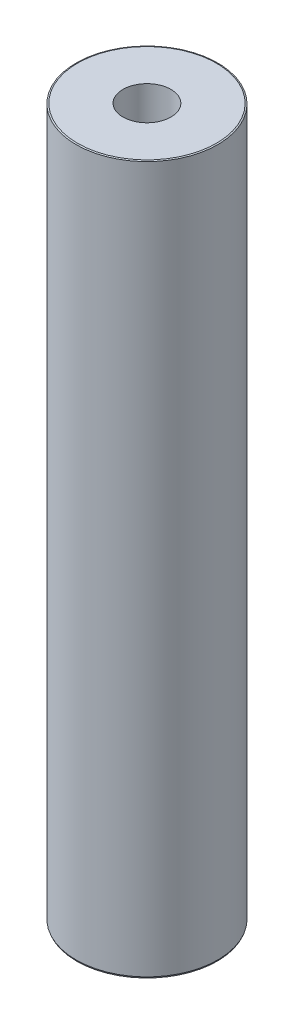
ISO-10303-21;
HEADER;
FILE_DESCRIPTION(('STEP AP214'),'2;1');
FILE_NAME('part.step','',(''),(''),'','','');
FILE_SCHEMA(('AUTOMOTIVE_DESIGN { 1 0 10303 214 1 1 1 1 }'));
ENDSEC;
DATA;
#1=APPLICATION_CONTEXT('core data for automotive mechanical design processes');
#2=APPLICATION_PROTOCOL_DEFINITION('international standard','automotive_design',2000,#1);
#3=PRODUCT_CONTEXT('',#1,'mechanical');
#4=PRODUCT('Part','Part','',(#3));
#5=PRODUCT_RELATED_PRODUCT_CATEGORY('part','',(#4));
#6=PRODUCT_DEFINITION_FORMATION('','',#4);
#7=PRODUCT_DEFINITION_CONTEXT('part definition',#1,'design');
#8=PRODUCT_DEFINITION('design','',#6,#7);
#9=PRODUCT_DEFINITION_SHAPE('','',#8);
#10=(LENGTH_UNIT() NAMED_UNIT(*) SI_UNIT(.MILLI.,.METRE.));
#11=(NAMED_UNIT(*) PLANE_ANGLE_UNIT() SI_UNIT($,.RADIAN.));
#12=(NAMED_UNIT(*) SI_UNIT($,.STERADIAN.) SOLID_ANGLE_UNIT());
#13=UNCERTAINTY_MEASURE_WITH_UNIT(LENGTH_MEASURE(1.E-05),#10,'distance_accuracy_value','');
#14=(GEOMETRIC_REPRESENTATION_CONTEXT(3) GLOBAL_UNCERTAINTY_ASSIGNED_CONTEXT((#13)) GLOBAL_UNIT_ASSIGNED_CONTEXT((#10,
#11,#12)) REPRESENTATION_CONTEXT('',''));
#15=CARTESIAN_POINT('',(0.,0.,0.));
#16=DIRECTION('',(0.,0.,1.));
#17=DIRECTION('',(1.,0.,0.));
#18=AXIS2_PLACEMENT_3D('',#15,#16,#17);
#19=CARTESIAN_POINT('',(0.,600.,0.));
#20=DIRECTION('',(0.,-1.,0.));
#21=DIRECTION('',(0.,0.,-1.));
#22=AXIS2_PLACEMENT_3D('',#19,#20,#21);
#23=CYLINDRICAL_SURFACE('',#22,60.);
#24=CARTESIAN_POINT('',(0.,599.572975668036,0.));
#25=DIRECTION('',(0.,1.,0.));
#26=DIRECTION('',(0.,0.,1.));
#27=AXIS2_PLACEMENT_3D('',#24,#25,#26);
#28=CIRCLE('',#27,60.);
#29=CARTESIAN_POINT('',(0.,599.572975668036,60.));
#30=VERTEX_POINT('',#29);
#31=EDGE_CURVE('E50',#30,#30,#28,.F.);
#32=ORIENTED_EDGE('',*,*,#31,.T.);
#33=EDGE_LOOP('',(#32));
#34=FACE_BOUND('',#33,.T.);
#35=CARTESIAN_POINT('',(0.,1.14513133027427,0.));
#36=DIRECTION('',(0.,1.,0.));
#37=DIRECTION('',(0.,0.,1.));
#38=AXIS2_PLACEMENT_3D('',#35,#36,#37);
#39=CIRCLE('',#38,60.);
#40=CARTESIAN_POINT('',(0.,1.14513133027427,60.));
#41=VERTEX_POINT('',#40);
#42=EDGE_CURVE('E51',#41,#41,#39,.T.);
#43=ORIENTED_EDGE('',*,*,#42,.T.);
#44=EDGE_LOOP('',(#43));
#45=FACE_BOUND('',#44,.T.);
#46=ADVANCED_FACE('F39',(#34,#45),#23,.T.);
#47=CARTESIAN_POINT('',(0.,600.,0.));
#48=DIRECTION('',(0.,1.,0.));
#49=DIRECTION('',(0.,0.,1.));
#50=AXIS2_PLACEMENT_3D('',#47,#48,#49);
#51=PLANE('',#50);
#52=CARTESIAN_POINT('',(0.,600.,0.));
#53=DIRECTION('',(0.,1.,0.));
#54=DIRECTION('',(0.,0.,1.));
#55=AXIS2_PLACEMENT_3D('',#52,#53,#54);
#56=CIRCLE('',#55,58.8548686697261);
#57=CARTESIAN_POINT('',(0.,600.,58.8548686697261));
#58=VERTEX_POINT('',#57);
#59=EDGE_CURVE('E54',#58,#58,#56,.T.);
#60=ORIENTED_EDGE('',*,*,#59,.T.);
#61=EDGE_LOOP('',(#60));
#62=FACE_BOUND('',#61,.T.);
#63=CARTESIAN_POINT('',(0.,600.,0.));
#64=DIRECTION('',(0.,1.,0.));
#65=DIRECTION('',(0.,0.,1.));
#66=AXIS2_PLACEMENT_3D('',#63,#64,#65);
#67=CIRCLE('',#66,20.3346537944548);
#68=CARTESIAN_POINT('',(0.,600.,20.3346537944548));
#69=VERTEX_POINT('',#68);
#70=EDGE_CURVE('E58',#69,#69,#67,.T.);
#71=ORIENTED_EDGE('',*,*,#70,.F.);
#72=EDGE_LOOP('',(#71));
#73=FACE_BOUND('',#72,.T.);
#74=ADVANCED_FACE('F69',(#62,#73),#51,.T.);
#75=CARTESIAN_POINT('',(0.,0.,0.));
#76=DIRECTION('',(0.,1.,0.));
#77=DIRECTION('',(0.,0.,1.));
#78=AXIS2_PLACEMENT_3D('',#75,#76,#77);
#79=PLANE('',#78);
#80=CARTESIAN_POINT('',(0.,0.,0.));
#81=DIRECTION('',(0.,1.,0.));
#82=DIRECTION('',(0.,0.,1.));
#83=AXIS2_PLACEMENT_3D('',#80,#81,#82);
#84=CIRCLE('',#83,59.5729756680359);
#85=CARTESIAN_POINT('',(0.,0.,59.5729756680359));
#86=VERTEX_POINT('',#85);
#87=EDGE_CURVE('E10',#86,#86,#84,.F.);
#88=ORIENTED_EDGE('',*,*,#87,.T.);
#89=EDGE_LOOP('',(#88));
#90=FACE_BOUND('',#89,.T.);
#91=CARTESIAN_POINT('',(0.,0.,0.));
#92=DIRECTION('',(0.,1.,0.));
#93=DIRECTION('',(0.,0.,1.));
#94=AXIS2_PLACEMENT_3D('',#91,#92,#93);
#95=CIRCLE('',#94,20.3346537944548);
#96=CARTESIAN_POINT('',(0.,0.,20.3346537944548));
#97=VERTEX_POINT('',#96);
#98=EDGE_CURVE('E63',#97,#97,#95,.T.);
#99=ORIENTED_EDGE('',*,*,#98,.T.);
#100=EDGE_LOOP('',(#99));
#101=FACE_BOUND('',#100,.T.);
#102=ADVANCED_FACE('F75',(#90,#101),#79,.F.);
#103=CARTESIAN_POINT('',(0.,600.,0.));
#104=DIRECTION('',(0.,-1.,0.));
#105=DIRECTION('',(0.,0.,-1.));
#106=AXIS2_PLACEMENT_3D('',#103,#104,#105);
#107=CYLINDRICAL_SURFACE('',#106,20.3346537944548);
#108=ORIENTED_EDGE('',*,*,#70,.T.);
#109=EDGE_LOOP('',(#108));
#110=FACE_BOUND('',#109,.T.);
#111=ORIENTED_EDGE('',*,*,#98,.F.);
#112=EDGE_LOOP('',(#111));
#113=FACE_BOUND('',#112,.T.);
#114=ADVANCED_FACE('F70',(#110,#113),#107,.F.);
#115=CARTESIAN_POINT('',(0.,600.,0.));
#116=DIRECTION('',(0.,-1.,0.));
#117=DIRECTION('',(0.,0.,-1.));
#118=AXIS2_PLACEMENT_3D('',#115,#116,#117);
#119=CONICAL_SURFACE('',#118,58.8548686697261,1.21386429722045);
#120=ORIENTED_EDGE('',*,*,#31,.F.);
#121=EDGE_LOOP('',(#120));
#122=FACE_BOUND('',#121,.T.);
#123=ORIENTED_EDGE('',*,*,#59,.F.);
#124=EDGE_LOOP('',(#123));
#125=FACE_BOUND('',#124,.T.);
#126=ADVANCED_FACE('F81',(#122,#125),#119,.T.);
#127=CARTESIAN_POINT('',(0.,1.14513133027427,0.));
#128=DIRECTION('',(0.,1.,0.));
#129=DIRECTION('',(0.,0.,1.));
#130=AXIS2_PLACEMENT_3D('',#127,#128,#129);
#131=CONICAL_SURFACE('',#130,60.,0.356932029574482);
#132=CARTESIAN_POINT('',(0.,0.,59.5729756680359));
#133=CARTESIAN_POINT('',(0.,0.0119284513570233,59.5774238381605));
#134=CARTESIAN_POINT('',(0.,0.0238569027140471,59.5818720082851));
#135=CARTESIAN_POINT('',(0.,0.0477138054280946,59.5907683485344));
#136=CARTESIAN_POINT('',(0.,0.0596422567851183,59.595216518659));
#137=CARTESIAN_POINT('',(0.,0.0834991594991654,59.6041128589082));
#138=CARTESIAN_POINT('',(0.,0.0954276108561888,59.6085610290329));
#139=CARTESIAN_POINT('',(0.,0.119284513570236,59.6174573692821));
#140=CARTESIAN_POINT('',(0.,0.131212964927261,59.6219055394067));
#141=CARTESIAN_POINT('',(0.,0.155069867641308,59.630801879656));
#142=CARTESIAN_POINT('',(0.,0.166998318998331,59.6352500497806));
#143=CARTESIAN_POINT('',(0.,0.190855221712379,59.6441463900299));
#144=CARTESIAN_POINT('',(0.,0.202783673069402,59.6485945601545));
#145=CARTESIAN_POINT('',(0.,0.22664057578345,59.6574909004038));
#146=CARTESIAN_POINT('',(0.,0.238569027140473,59.6619390705284));
#147=CARTESIAN_POINT('',(0.,0.262425929854521,59.6708354107776));
#148=CARTESIAN_POINT('',(0.,0.274354381211545,59.6752835809023));
#149=CARTESIAN_POINT('',(0.,0.298211283925592,59.6841799211515));
#150=CARTESIAN_POINT('',(0.,0.310139735282615,59.6886280912761));
#151=CARTESIAN_POINT('',(0.,0.333996637996663,59.6975244315254));
#152=CARTESIAN_POINT('',(0.,0.345925089353687,59.70197260165));
#153=CARTESIAN_POINT('',(0.,0.369781992067734,59.7108689418993));
#154=CARTESIAN_POINT('',(0.,0.381710443424758,59.7153171120239));
#155=CARTESIAN_POINT('',(0.,0.405567346138805,59.7242134522732));
#156=CARTESIAN_POINT('',(0.,0.417495797495829,59.7286616223978));
#157=CARTESIAN_POINT('',(0.,0.441352700209876,59.737557962647));
#158=CARTESIAN_POINT('',(0.,0.4532811515669,59.7420061327717));
#159=CARTESIAN_POINT('',(0.,0.477138054280947,59.7509024730209));
#160=CARTESIAN_POINT('',(0.,0.489066505637971,59.7553506431455));
#161=CARTESIAN_POINT('',(0.,0.512923408352018,59.7642469833948));
#162=CARTESIAN_POINT('',(0.,0.524851859709041,59.7686951535194));
#163=CARTESIAN_POINT('',(0.,0.548708762423089,59.7775914937687));
#164=CARTESIAN_POINT('',(0.,0.560637213780113,59.7820396638933));
#165=CARTESIAN_POINT('',(0.,0.584494116494161,59.7909360041426));
#166=CARTESIAN_POINT('',(0.,0.596422567851184,59.7953841742672));
#167=CARTESIAN_POINT('',(0.,0.620279470565231,59.8042805145164));
#168=CARTESIAN_POINT('',(0.,0.632207921922255,59.8087286846411));
#169=CARTESIAN_POINT('',(0.,0.656064824636303,59.8176250248903));
#170=CARTESIAN_POINT('',(0.,0.667993275993326,59.8220731950149));
#171=CARTESIAN_POINT('',(0.,0.691850178707374,59.8309695352642));
#172=CARTESIAN_POINT('',(0.,0.703778630064397,59.8354177053888));
#173=CARTESIAN_POINT('',(0.,0.727635532778445,59.8443140456381));
#174=CARTESIAN_POINT('',(0.,0.739563984135469,59.8487622157627));
#175=CARTESIAN_POINT('',(0.,0.763420886849515,59.857658556012));
#176=CARTESIAN_POINT('',(0.,0.775349338206539,59.8621067261366));
#177=CARTESIAN_POINT('',(0.,0.799206240920586,59.8710030663858));
#178=CARTESIAN_POINT('',(0.,0.811134692277611,59.8754512365105));
#179=CARTESIAN_POINT('',(0.,0.834991594991658,59.8843475767597));
#180=CARTESIAN_POINT('',(0.,0.846920046348682,59.8887957468843));
#181=CARTESIAN_POINT('',(0.,0.870776949062729,59.8976920871336));
#182=CARTESIAN_POINT('',(0.,0.882705400419753,59.9021402572582));
#183=CARTESIAN_POINT('',(0.,0.9065623031338,59.9110365975075));
#184=CARTESIAN_POINT('',(0.,0.918490754490824,59.9154847676321));
#185=CARTESIAN_POINT('',(0.,0.942347657204871,59.9243811078813));
#186=CARTESIAN_POINT('',(0.,0.954276108561895,59.928829278006));
#187=CARTESIAN_POINT('',(0.,0.978133011275942,59.9377256182552));
#188=CARTESIAN_POINT('',(0.,0.990061462632965,59.9421737883799));
#189=CARTESIAN_POINT('',(0.,1.01391836534701,59.9510701286291));
#190=CARTESIAN_POINT('',(0.,1.02584681670404,59.9555182987537));
#191=CARTESIAN_POINT('',(0.,1.04970371941808,59.964414639003));
#192=CARTESIAN_POINT('',(0.,1.06163217077511,59.9688628091276));
#193=CARTESIAN_POINT('',(0.,1.08548907348916,59.9777591493769));
#194=CARTESIAN_POINT('',(0.,1.09741752484618,59.9822073195015));
#195=CARTESIAN_POINT('',(0.,1.12127442756023,59.9911036597507));
#196=CARTESIAN_POINT('',(0.,1.13320287891725,59.9955518298754));
#197=CARTESIAN_POINT('',(0.,1.14513133027427,60.));
#198=B_SPLINE_CURVE_WITH_KNOTS('',3,(#132,#133,#134,#135,#136,#137,#138,#139,#140,#141,#142,
#143,#144,#145,#146,#147,#148,#149,#150,#151,#152,#153,#154,#155,#156,#157,#158,#159,#160,#161,
#162,#163,#164,#165,#166,#167,#168,#169,#170,#171,#172,#173,#174,#175,#176,#177,#178,#179,#180,
#181,#182,#183,#184,#185,#186,#187,#188,#189,#190,#191,#192,#193,#194,#195,#196,#197),
.UNSPECIFIED.,.F.,.F.,(4,2,2,2,2,2,2,2,2,2,2,2,2,2,2,2,2,2,2,2,2,2,2,2,2,2,2,2,2,2,2,2,4),(0.,
0.0381925061119394,0.0763850122238788,0.114577518335818,0.152770024447755,0.190962530559694,
0.229155036671634,0.267347542783573,0.305540048895513,0.343732555007452,0.381925061119389,
0.420117567231328,0.458310073343268,0.496502579455207,0.534695085567146,0.572887591679086,
0.611080097791023,0.649272603902962,0.687465110014902,0.725657616126841,0.76385012223878,
0.80204262835072,0.840235134462659,0.878427640574596,0.916620146686535,0.954812652798475,
0.993005158910414,1.03119766502235,1.06939017113429,1.10758267724623,1.14577518335817,
1.18396768947011,1.22216019558205),.UNSPECIFIED.);
#199=EDGE_CURVE('BSEAM45',#86,#41,#198,.T.);
#200=ORIENTED_EDGE('',*,*,#87,.F.);
#201=ORIENTED_EDGE('',*,*,#42,.F.);
#202=ORIENTED_EDGE('',*,*,#199,.T.);
#203=ORIENTED_EDGE('',*,*,#199,.F.);
#204=EDGE_LOOP('',(#200,#202,#201,#203));
#205=FACE_BOUND('',#204,.T.);
#206=ADVANCED_FACE('F45',(#205),#131,.T.);
#207=CLOSED_SHELL('',(#46,#74,#102,#114,#126,#206));
#208=MANIFOLD_SOLID_BREP('B2',#207);
#209=ADVANCED_BREP_SHAPE_REPRESENTATION('',(#18,#208),#14);
#210=SHAPE_DEFINITION_REPRESENTATION(#9,#209);
ENDSEC;
END-ISO-10303-21;
